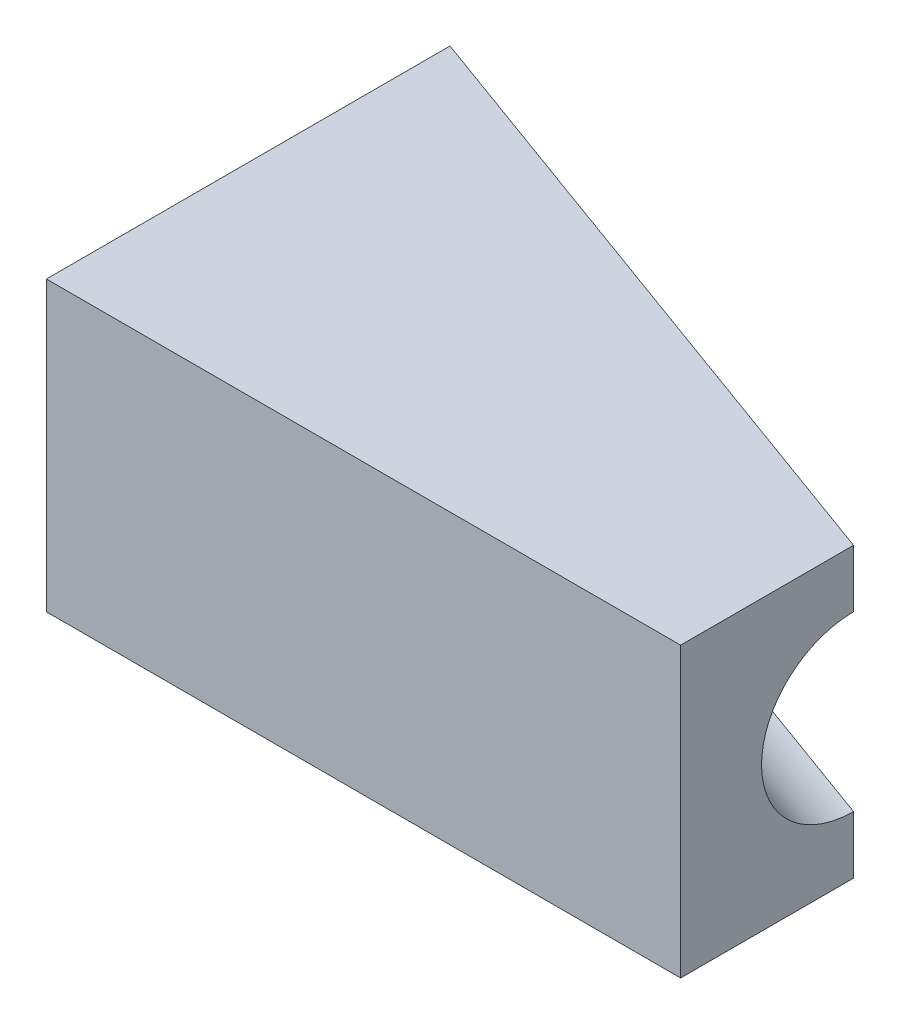
ISO-10303-21;
HEADER;
FILE_DESCRIPTION(('STEP AP214'),'2;1');
FILE_NAME('part.step','',(''),(''),'','','');
FILE_SCHEMA(('AUTOMOTIVE_DESIGN { 1 0 10303 214 1 1 1 1 }'));
ENDSEC;
DATA;
#1=APPLICATION_CONTEXT('core data for automotive mechanical design processes');
#2=APPLICATION_PROTOCOL_DEFINITION('international standard','automotive_design',2000,#1);
#3=PRODUCT_CONTEXT('',#1,'mechanical');
#4=PRODUCT('Part','Part','',(#3));
#5=PRODUCT_RELATED_PRODUCT_CATEGORY('part','',(#4));
#6=PRODUCT_DEFINITION_FORMATION('','',#4);
#7=PRODUCT_DEFINITION_CONTEXT('part definition',#1,'design');
#8=PRODUCT_DEFINITION('design','',#6,#7);
#9=PRODUCT_DEFINITION_SHAPE('','',#8);
#10=(LENGTH_UNIT() NAMED_UNIT(*) SI_UNIT(.MILLI.,.METRE.));
#11=(NAMED_UNIT(*) PLANE_ANGLE_UNIT() SI_UNIT($,.RADIAN.));
#12=(NAMED_UNIT(*) SI_UNIT($,.STERADIAN.) SOLID_ANGLE_UNIT());
#13=UNCERTAINTY_MEASURE_WITH_UNIT(LENGTH_MEASURE(1.E-05),#10,'distance_accuracy_value','');
#14=(GEOMETRIC_REPRESENTATION_CONTEXT(3) GLOBAL_UNCERTAINTY_ASSIGNED_CONTEXT((#13)) GLOBAL_UNIT_ASSIGNED_CONTEXT((#10,
#11,#12)) REPRESENTATION_CONTEXT('',''));
#15=CARTESIAN_POINT('',(0.,0.,0.));
#16=DIRECTION('',(0.,0.,1.));
#17=DIRECTION('',(1.,0.,0.));
#18=AXIS2_PLACEMENT_3D('',#15,#16,#17);
#19=CARTESIAN_POINT('',(110.,50.,30.));
#20=DIRECTION('',(-1.,0.,0.));
#21=DIRECTION('',(0.,0.,1.));
#22=AXIS2_PLACEMENT_3D('',#19,#20,#21);
#23=PLANE('',#22);
#24=CARTESIAN_POINT('',(110.,25.,0.));
#25=DIRECTION('',(-1.,0.,0.));
#26=DIRECTION('',(0.,0.,-1.));
#27=AXIS2_PLACEMENT_3D('',#24,#25,#26);
#28=ELLIPSE('',#27,15.9609544237086,15.);
#29=CARTESIAN_POINT('',(110.,40.,0.));
#30=VERTEX_POINT('',#29);
#31=CARTESIAN_POINT('',(110.,10.,0.));
#32=VERTEX_POINT('',#31);
#33=EDGE_CURVE('E105',#30,#32,#28,.F.);
#34=ORIENTED_EDGE('',*,*,#33,.F.);
#35=DIRECTION('',(0.,-1.,0.));
#36=VECTOR('',#35,1.);
#37=CARTESIAN_POINT('',(110.,50.,0.));
#38=LINE('',#37,#36);
#39=CARTESIAN_POINT('',(110.,50.,0.));
#40=VERTEX_POINT('',#39);
#41=EDGE_CURVE('E104',#40,#30,#38,.T.);
#42=ORIENTED_EDGE('',*,*,#41,.F.);
#43=DIRECTION('',(0.,0.,-1.));
#44=VECTOR('',#43,1.);
#45=CARTESIAN_POINT('',(110.,50.,30.));
#46=LINE('',#45,#44);
#47=CARTESIAN_POINT('',(110.,50.,30.));
#48=VERTEX_POINT('',#47);
#49=EDGE_CURVE('E138',#48,#40,#46,.T.);
#50=ORIENTED_EDGE('',*,*,#49,.F.);
#51=DIRECTION('',(0.,-1.,0.));
#52=VECTOR('',#51,1.);
#53=CARTESIAN_POINT('',(110.,50.,30.));
#54=LINE('',#53,#52);
#55=CARTESIAN_POINT('',(110.,0.,30.));
#56=VERTEX_POINT('',#55);
#57=EDGE_CURVE('E116',#48,#56,#54,.T.);
#58=ORIENTED_EDGE('',*,*,#57,.T.);
#59=DIRECTION('',(0.,0.,-1.));
#60=VECTOR('',#59,1.);
#61=CARTESIAN_POINT('',(110.,0.,30.));
#62=LINE('',#61,#60);
#63=CARTESIAN_POINT('',(110.,0.,0.));
#64=VERTEX_POINT('',#63);
#65=EDGE_CURVE('E127',#56,#64,#62,.T.);
#66=ORIENTED_EDGE('',*,*,#65,.T.);
#67=EDGE_CURVE('E108',#32,#64,#38,.T.);
#68=ORIENTED_EDGE('',*,*,#67,.F.);
#69=EDGE_LOOP('',(#34,#42,#50,#58,#66,#68));
#70=FACE_BOUND('',#69,.T.);
#71=ADVANCED_FACE('F35',(#70),#23,.F.);
#72=CARTESIAN_POINT('',(0.,50.,-40.));
#73=DIRECTION('',(-0.341743063086704,0.,0.939793423488437));
#74=DIRECTION('',(0.939793423488437,0.,0.341743063086704));
#75=AXIS2_PLACEMENT_3D('',#72,#73,#74);
#76=PLANE('',#75);
#77=DIRECTION('',(-0.939793423488437,0.,-0.341743063086704));
#78=VECTOR('',#77,1.);
#79=CARTESIAN_POINT('',(119.63503649635,40.,3.5036496350365));
#80=LINE('',#79,#78);
#81=CARTESIAN_POINT('',(0.,40.,-40.));
#82=VERTEX_POINT('',#81);
#83=EDGE_CURVE('E95',#82,#30,#80,.F.);
#84=ORIENTED_EDGE('',*,*,#83,.F.);
#85=DIRECTION('',(0.,-1.,0.));
#86=VECTOR('',#85,1.);
#87=CARTESIAN_POINT('',(0.,50.,-40.));
#88=LINE('',#87,#86);
#89=CARTESIAN_POINT('',(0.,50.,-40.));
#90=VERTEX_POINT('',#89);
#91=EDGE_CURVE('E102',#90,#82,#88,.T.);
#92=ORIENTED_EDGE('',*,*,#91,.F.);
#93=DIRECTION('',(-0.939793423488437,0.,-0.341743063086704));
#94=VECTOR('',#93,1.);
#95=CARTESIAN_POINT('',(0.,50.,-40.));
#96=LINE('',#95,#94);
#97=EDGE_CURVE('E111',#40,#90,#96,.T.);
#98=ORIENTED_EDGE('',*,*,#97,.F.);
#99=ORIENTED_EDGE('',*,*,#41,.T.);
#100=EDGE_LOOP('',(#84,#92,#98,#99));
#101=FACE_BOUND('',#100,.T.);
#102=ADVANCED_FACE('F100',(#101),#76,.F.);
#103=DIRECTION('',(-0.939793423488437,0.,-0.341743063086704));
#104=VECTOR('',#103,1.);
#105=CARTESIAN_POINT('',(119.63503649635,10.,3.5036496350365));
#106=LINE('',#105,#104);
#107=CARTESIAN_POINT('',(0.,10.,-40.));
#108=VERTEX_POINT('',#107);
#109=EDGE_CURVE('E49',#32,#108,#106,.T.);
#110=ORIENTED_EDGE('',*,*,#109,.F.);
#111=ORIENTED_EDGE('',*,*,#67,.T.);
#112=DIRECTION('',(-0.939793423488437,0.,-0.341743063086704));
#113=VECTOR('',#112,1.);
#114=CARTESIAN_POINT('',(0.,0.,-40.));
#115=LINE('',#114,#113);
#116=CARTESIAN_POINT('',(0.,0.,-40.));
#117=VERTEX_POINT('',#116);
#118=EDGE_CURVE('E123',#64,#117,#115,.T.);
#119=ORIENTED_EDGE('',*,*,#118,.T.);
#120=EDGE_CURVE('E78',#108,#117,#88,.T.);
#121=ORIENTED_EDGE('',*,*,#120,.F.);
#122=EDGE_LOOP('',(#110,#111,#119,#121));
#123=FACE_BOUND('',#122,.T.);
#124=ADVANCED_FACE('F134',(#123),#76,.F.);
#125=CARTESIAN_POINT('',(0.,50.,0.));
#126=DIRECTION('',(1.,0.,0.));
#127=DIRECTION('',(0.,0.,-1.));
#128=AXIS2_PLACEMENT_3D('',#125,#126,#127);
#129=PLANE('',#128);
#130=CARTESIAN_POINT('',(0.,25.,-40.));
#131=DIRECTION('',(1.,0.,0.));
#132=DIRECTION('',(0.,0.,-1.));
#133=AXIS2_PLACEMENT_3D('',#130,#131,#132);
#134=ELLIPSE('',#133,15.9609544237086,15.);
#135=EDGE_CURVE('E11',#108,#82,#134,.F.);
#136=ORIENTED_EDGE('',*,*,#135,.F.);
#137=ORIENTED_EDGE('',*,*,#120,.T.);
#138=DIRECTION('',(0.,0.,1.));
#139=VECTOR('',#138,1.);
#140=CARTESIAN_POINT('',(0.,0.,0.));
#141=LINE('',#140,#139);
#142=CARTESIAN_POINT('',(0.,0.,30.));
#143=VERTEX_POINT('',#142);
#144=EDGE_CURVE('E113',#117,#143,#141,.T.);
#145=ORIENTED_EDGE('',*,*,#144,.T.);
#146=DIRECTION('',(0.,-1.,0.));
#147=VECTOR('',#146,1.);
#148=CARTESIAN_POINT('',(0.,50.,30.));
#149=LINE('',#148,#147);
#150=CARTESIAN_POINT('',(0.,50.,30.));
#151=VERTEX_POINT('',#150);
#152=EDGE_CURVE('E43',#151,#143,#149,.T.);
#153=ORIENTED_EDGE('',*,*,#152,.F.);
#154=DIRECTION('',(0.,0.,1.));
#155=VECTOR('',#154,1.);
#156=CARTESIAN_POINT('',(0.,50.,0.));
#157=LINE('',#156,#155);
#158=EDGE_CURVE('E58',#90,#151,#157,.T.);
#159=ORIENTED_EDGE('',*,*,#158,.F.);
#160=ORIENTED_EDGE('',*,*,#91,.T.);
#161=EDGE_LOOP('',(#136,#137,#145,#153,#159,#160));
#162=FACE_BOUND('',#161,.T.);
#163=ADVANCED_FACE('F107',(#162),#129,.F.);
#164=CARTESIAN_POINT('',(0.,50.,30.));
#165=DIRECTION('',(0.,0.,-1.));
#166=DIRECTION('',(-1.,0.,0.));
#167=AXIS2_PLACEMENT_3D('',#164,#165,#166);
#168=PLANE('',#167);
#169=DIRECTION('',(1.,0.,0.));
#170=VECTOR('',#169,1.);
#171=CARTESIAN_POINT('',(0.,0.,30.));
#172=LINE('',#171,#170);
#173=EDGE_CURVE('E119',#143,#56,#172,.T.);
#174=ORIENTED_EDGE('',*,*,#173,.T.);
#175=ORIENTED_EDGE('',*,*,#57,.F.);
#176=DIRECTION('',(1.,0.,0.));
#177=VECTOR('',#176,1.);
#178=CARTESIAN_POINT('',(0.,50.,30.));
#179=LINE('',#178,#177);
#180=EDGE_CURVE('E86',#151,#48,#179,.T.);
#181=ORIENTED_EDGE('',*,*,#180,.F.);
#182=ORIENTED_EDGE('',*,*,#152,.T.);
#183=EDGE_LOOP('',(#174,#175,#181,#182));
#184=FACE_BOUND('',#183,.T.);
#185=ADVANCED_FACE('F37',(#184),#168,.F.);
#186=CARTESIAN_POINT('',(0.,50.,0.));
#187=DIRECTION('',(0.,1.,0.));
#188=DIRECTION('',(0.,0.,1.));
#189=AXIS2_PLACEMENT_3D('',#186,#187,#188);
#190=PLANE('',#189);
#191=ORIENTED_EDGE('',*,*,#158,.T.);
#192=ORIENTED_EDGE('',*,*,#180,.T.);
#193=ORIENTED_EDGE('',*,*,#49,.T.);
#194=ORIENTED_EDGE('',*,*,#97,.T.);
#195=EDGE_LOOP('',(#191,#192,#193,#194));
#196=FACE_BOUND('',#195,.T.);
#197=ADVANCED_FACE('F143',(#196),#190,.T.);
#198=CARTESIAN_POINT('',(0.,0.,0.));
#199=DIRECTION('',(0.,1.,0.));
#200=DIRECTION('',(0.,0.,1.));
#201=AXIS2_PLACEMENT_3D('',#198,#199,#200);
#202=PLANE('',#201);
#203=ORIENTED_EDGE('',*,*,#173,.F.);
#204=ORIENTED_EDGE('',*,*,#144,.F.);
#205=ORIENTED_EDGE('',*,*,#118,.F.);
#206=ORIENTED_EDGE('',*,*,#65,.F.);
#207=EDGE_LOOP('',(#203,#204,#205,#206));
#208=FACE_BOUND('',#207,.T.);
#209=ADVANCED_FACE('F125',(#208),#202,.F.);
#210=CARTESIAN_POINT('',(119.63503649635,25.,3.5036496350365));
#211=DIRECTION('',(-0.939793423488437,0.,-0.341743063086704));
#212=DIRECTION('',(-0.341743063086704,0.,0.939793423488437));
#213=AXIS2_PLACEMENT_3D('',#210,#211,#212);
#214=CYLINDRICAL_SURFACE('',#213,15.);
#215=ORIENTED_EDGE('',*,*,#33,.T.);
#216=ORIENTED_EDGE('',*,*,#109,.T.);
#217=ORIENTED_EDGE('',*,*,#135,.T.);
#218=ORIENTED_EDGE('',*,*,#83,.T.);
#219=EDGE_LOOP('',(#215,#216,#217,#218));
#220=FACE_BOUND('',#219,.T.);
#221=ADVANCED_FACE('F94',(#220),#214,.F.);
#222=CLOSED_SHELL('',(#71,#102,#124,#163,#185,#197,#209,#221));
#223=MANIFOLD_SOLID_BREP('B2',#222);
#224=ADVANCED_BREP_SHAPE_REPRESENTATION('',(#18,#223),#14);
#225=SHAPE_DEFINITION_REPRESENTATION(#9,#224);
ENDSEC;
END-ISO-10303-21;
